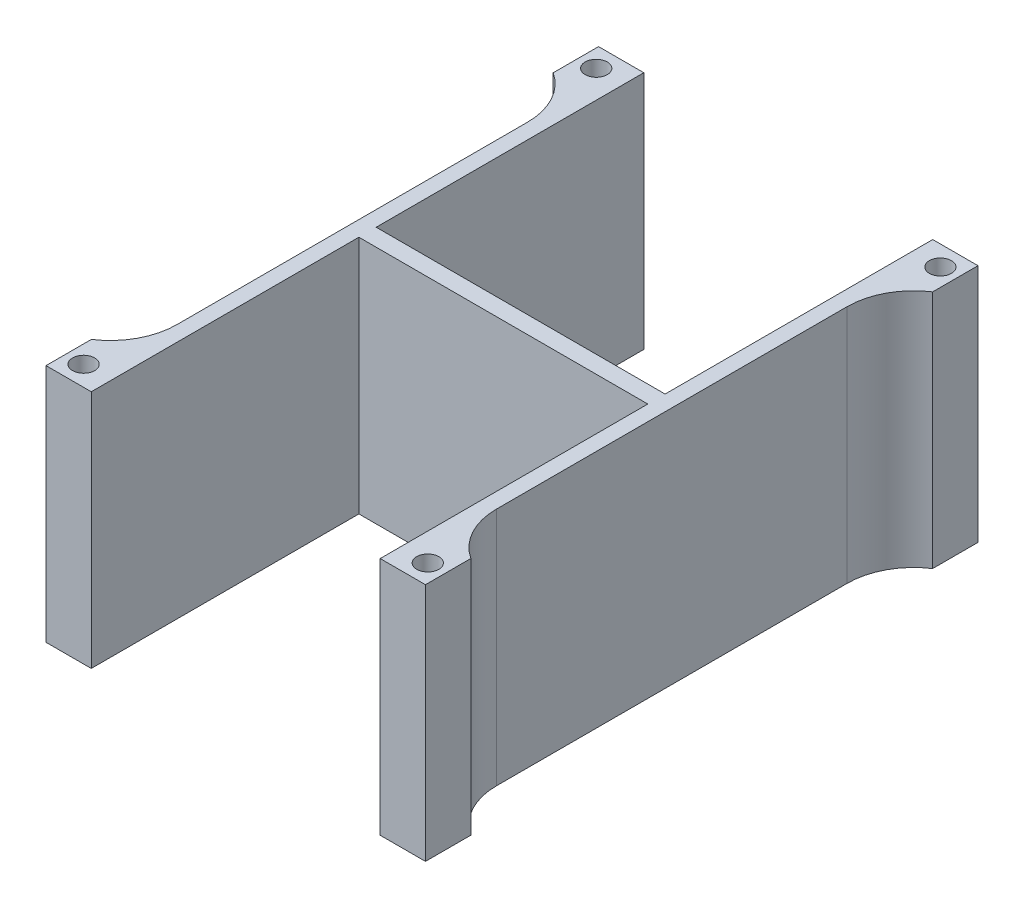
ISO-10303-21;
HEADER;
FILE_DESCRIPTION(('STEP AP214'),'2;1');
FILE_NAME('part.step','',(''),(''),'','','');
FILE_SCHEMA(('AUTOMOTIVE_DESIGN { 1 0 10303 214 1 1 1 1 }'));
ENDSEC;
DATA;
#1=APPLICATION_CONTEXT('core data for automotive mechanical design processes');
#2=APPLICATION_PROTOCOL_DEFINITION('international standard','automotive_design',2000,#1);
#3=PRODUCT_CONTEXT('',#1,'mechanical');
#4=PRODUCT('Part','Part','',(#3));
#5=PRODUCT_RELATED_PRODUCT_CATEGORY('part','',(#4));
#6=PRODUCT_DEFINITION_FORMATION('','',#4);
#7=PRODUCT_DEFINITION_CONTEXT('part definition',#1,'design');
#8=PRODUCT_DEFINITION('design','',#6,#7);
#9=PRODUCT_DEFINITION_SHAPE('','',#8);
#10=(LENGTH_UNIT() NAMED_UNIT(*) SI_UNIT(.MILLI.,.METRE.));
#11=(NAMED_UNIT(*) PLANE_ANGLE_UNIT() SI_UNIT($,.RADIAN.));
#12=(NAMED_UNIT(*) SI_UNIT($,.STERADIAN.) SOLID_ANGLE_UNIT());
#13=UNCERTAINTY_MEASURE_WITH_UNIT(LENGTH_MEASURE(1.E-05),#10,'distance_accuracy_value','');
#14=(GEOMETRIC_REPRESENTATION_CONTEXT(3) GLOBAL_UNCERTAINTY_ASSIGNED_CONTEXT((#13)) GLOBAL_UNIT_ASSIGNED_CONTEXT((#10,
#11,#12)) REPRESENTATION_CONTEXT('',''));
#15=CARTESIAN_POINT('',(0.,0.,0.));
#16=DIRECTION('',(0.,0.,1.));
#17=DIRECTION('',(1.,0.,0.));
#18=AXIS2_PLACEMENT_3D('',#15,#16,#17);
#19=CARTESIAN_POINT('',(-2.49999999999993,43.0000000000001,40.));
#20=DIRECTION('',(1.,0.,0.));
#21=DIRECTION('',(0.,1.,0.));
#22=AXIS2_PLACEMENT_3D('',#19,#20,#21);
#23=PLANE('',#22);
#24=DIRECTION('',(0.,0.,-1.));
#25=VECTOR('',#24,1.);
#26=CARTESIAN_POINT('',(-2.50000000000007,0.,-1.501));
#27=LINE('',#26,#25);
#28=CARTESIAN_POINT('',(-2.50000000000007,0.,24.8348486100883));
#29=VERTEX_POINT('',#28);
#30=CARTESIAN_POINT('',(-2.50000000000007,0.,-27.8348486100883));
#31=VERTEX_POINT('',#30);
#32=EDGE_CURVE('E240',#29,#31,#27,.T.);
#33=ORIENTED_EDGE('',*,*,#32,.F.);
#34=DIRECTION('',(0.,1.,0.));
#35=VECTOR('',#34,1.);
#36=CARTESIAN_POINT('',(-2.49999999999993,43.0000000000001,24.8348486100883));
#37=LINE('',#36,#35);
#38=CARTESIAN_POINT('',(-2.49999999999994,36.0000000000001,24.8348486100883));
#39=VERTEX_POINT('',#38);
#40=EDGE_CURVE('E227',#29,#39,#37,.T.);
#41=ORIENTED_EDGE('',*,*,#40,.T.);
#42=DIRECTION('',(0.,0.,1.));
#43=VECTOR('',#42,1.);
#44=CARTESIAN_POINT('',(-2.49999999999995,36.0000000000001,-43.));
#45=LINE('',#44,#43);
#46=CARTESIAN_POINT('',(-2.49999999999995,36.0000000000001,-27.8348486100883));
#47=VERTEX_POINT('',#46);
#48=EDGE_CURVE('E251',#47,#39,#45,.T.);
#49=ORIENTED_EDGE('',*,*,#48,.F.);
#50=DIRECTION('',(0.,1.,0.));
#51=VECTOR('',#50,1.);
#52=CARTESIAN_POINT('',(-2.49999999999993,43.0000000000001,-27.8348486100883));
#53=LINE('',#52,#51);
#54=EDGE_CURVE('E203',#47,#31,#53,.F.);
#55=ORIENTED_EDGE('',*,*,#54,.T.);
#56=EDGE_LOOP('',(#33,#41,#49,#55));
#57=FACE_BOUND('',#56,.T.);
#58=ADVANCED_FACE('F41',(#57),#23,.F.);
#59=CARTESIAN_POINT('',(45.5000000000001,42.9999999999999,40.));
#60=DIRECTION('',(-1.,0.,0.));
#61=DIRECTION('',(0.,-1.,0.));
#62=AXIS2_PLACEMENT_3D('',#59,#60,#61);
#63=PLANE('',#62);
#64=DIRECTION('',(0.,0.,-1.));
#65=VECTOR('',#64,1.);
#66=CARTESIAN_POINT('',(45.5000000000001,35.9999999999997,-43.));
#67=LINE('',#66,#65);
#68=CARTESIAN_POINT('',(45.5000000000001,35.9999999999997,24.8348486100883));
#69=VERTEX_POINT('',#68);
#70=CARTESIAN_POINT('',(45.5000000000001,35.9999999999997,-27.8348486100883));
#71=VERTEX_POINT('',#70);
#72=EDGE_CURVE('E225',#69,#71,#67,.T.);
#73=ORIENTED_EDGE('',*,*,#72,.F.);
#74=DIRECTION('',(0.,-1.,0.));
#75=VECTOR('',#74,1.);
#76=CARTESIAN_POINT('',(45.5000000000001,42.9999999999999,24.8348486100883));
#77=LINE('',#76,#75);
#78=CARTESIAN_POINT('',(45.5,0.,24.8348486100883));
#79=VERTEX_POINT('',#78);
#80=EDGE_CURVE('E291',#69,#79,#77,.T.);
#81=ORIENTED_EDGE('',*,*,#80,.T.);
#82=DIRECTION('',(0.,0.,1.));
#83=VECTOR('',#82,1.);
#84=CARTESIAN_POINT('',(45.5,0.,-1.501));
#85=LINE('',#84,#83);
#86=CARTESIAN_POINT('',(45.5,0.,-27.8348486100883));
#87=VERTEX_POINT('',#86);
#88=EDGE_CURVE('E246',#87,#79,#85,.T.);
#89=ORIENTED_EDGE('',*,*,#88,.F.);
#90=DIRECTION('',(0.,-1.,0.));
#91=VECTOR('',#90,1.);
#92=CARTESIAN_POINT('',(45.5000000000001,42.9999999999998,-27.8348486100883));
#93=LINE('',#92,#91);
#94=EDGE_CURVE('E289',#87,#71,#93,.F.);
#95=ORIENTED_EDGE('',*,*,#94,.T.);
#96=EDGE_LOOP('',(#73,#81,#89,#95));
#97=FACE_BOUND('',#96,.T.);
#98=ADVANCED_FACE('F407',(#97),#63,.F.);
#99=CARTESIAN_POINT('',(-0.200000000000358,0.,40.));
#100=DIRECTION('',(-1.,0.,0.));
#101=DIRECTION('',(0.,-1.,0.));
#102=AXIS2_PLACEMENT_3D('',#99,#100,#101);
#103=PLANE('',#102);
#104=DIRECTION('',(0.,0.,1.));
#105=VECTOR('',#104,1.);
#106=CARTESIAN_POINT('',(-0.200000000000053,36.0000000000001,0.));
#107=LINE('',#106,#105);
#108=CARTESIAN_POINT('',(-0.200000000000053,35.9999999999999,-0.200000000000008));
#109=VERTEX_POINT('',#108);
#110=CARTESIAN_POINT('',(-0.200000000000058,36.0000000000001,40.));
#111=VERTEX_POINT('',#110);
#112=EDGE_CURVE('E279',#109,#111,#107,.T.);
#113=ORIENTED_EDGE('',*,*,#112,.T.);
#114=DIRECTION('',(0.,1.,0.));
#115=VECTOR('',#114,1.);
#116=CARTESIAN_POINT('',(-0.200000000000358,0.,40.));
#117=LINE('',#116,#115);
#118=CARTESIAN_POINT('',(-0.200000000000358,0.,40.));
#119=VERTEX_POINT('',#118);
#120=EDGE_CURVE('E348',#119,#111,#117,.T.);
#121=ORIENTED_EDGE('',*,*,#120,.F.);
#122=DIRECTION('',(0.,0.,1.));
#123=VECTOR('',#122,1.);
#124=CARTESIAN_POINT('',(-0.200000000000358,0.,40.));
#125=LINE('',#124,#123);
#126=CARTESIAN_POINT('',(-0.200000000000353,0.,-0.200000000000008));
#127=VERTEX_POINT('',#126);
#128=EDGE_CURVE('E371',#127,#119,#125,.T.);
#129=ORIENTED_EDGE('',*,*,#128,.F.);
#130=DIRECTION('',(0.,1.,0.));
#131=VECTOR('',#130,1.);
#132=CARTESIAN_POINT('',(-0.200000000000353,0.,-0.200000000000008));
#133=LINE('',#132,#131);
#134=EDGE_CURVE('E375',#127,#109,#133,.T.);
#135=ORIENTED_EDGE('',*,*,#134,.T.);
#136=EDGE_LOOP('',(#113,#121,#129,#135));
#137=FACE_BOUND('',#136,.T.);
#138=ADVANCED_FACE('F413',(#137),#103,.F.);
#139=CARTESIAN_POINT('',(43.1999999999996,-3.81639164714898E-13,-0.200000000000008));
#140=DIRECTION('',(1.,0.,0.));
#141=DIRECTION('',(0.,1.,0.));
#142=AXIS2_PLACEMENT_3D('',#139,#140,#141);
#143=PLANE('',#142);
#144=DIRECTION('',(0.,1.,0.));
#145=VECTOR('',#144,1.);
#146=CARTESIAN_POINT('',(43.1999999999996,-3.81639164714898E-13,40.));
#147=LINE('',#146,#145);
#148=CARTESIAN_POINT('',(43.1999999999996,-3.81639164714898E-13,40.));
#149=VERTEX_POINT('',#148);
#150=CARTESIAN_POINT('',(43.1999999999999,35.9999999999997,40.));
#151=VERTEX_POINT('',#150);
#152=EDGE_CURVE('E368',#149,#151,#147,.T.);
#153=ORIENTED_EDGE('',*,*,#152,.T.);
#154=DIRECTION('',(0.,0.,-1.));
#155=VECTOR('',#154,1.);
#156=CARTESIAN_POINT('',(43.1999999999999,35.9999999999997,0.));
#157=LINE('',#156,#155);
#158=CARTESIAN_POINT('',(43.1999999999999,35.9999999999997,-0.200000000000008));
#159=VERTEX_POINT('',#158);
#160=EDGE_CURVE('E275',#151,#159,#157,.T.);
#161=ORIENTED_EDGE('',*,*,#160,.T.);
#162=DIRECTION('',(0.,1.,0.));
#163=VECTOR('',#162,1.);
#164=CARTESIAN_POINT('',(43.1999999999996,-3.81639164714898E-13,-0.200000000000008));
#165=LINE('',#164,#163);
#166=CARTESIAN_POINT('',(43.1999999999996,-3.81639164714898E-13,-0.200000000000008));
#167=VERTEX_POINT('',#166);
#168=EDGE_CURVE('E372',#167,#159,#165,.T.);
#169=ORIENTED_EDGE('',*,*,#168,.F.);
#170=DIRECTION('',(0.,0.,-1.));
#171=VECTOR('',#170,1.);
#172=CARTESIAN_POINT('',(43.1999999999996,-3.81639164714898E-13,-0.200000000000008));
#173=LINE('',#172,#171);
#174=EDGE_CURVE('E262',#149,#167,#173,.T.);
#175=ORIENTED_EDGE('',*,*,#174,.F.);
#176=EDGE_LOOP('',(#153,#161,#169,#175));
#177=FACE_BOUND('',#176,.T.);
#178=ADVANCED_FACE('F388',(#177),#143,.F.);
#179=CARTESIAN_POINT('',(43.1999999999996,-3.81639164714898E-13,-2.79999999999999));
#180=DIRECTION('',(1.,0.,0.));
#181=DIRECTION('',(0.,1.,0.));
#182=AXIS2_PLACEMENT_3D('',#179,#180,#181);
#183=PLANE('',#182);
#184=DIRECTION('',(0.,0.,-1.));
#185=VECTOR('',#184,1.);
#186=CARTESIAN_POINT('',(43.1999999999999,35.9999999999997,0.));
#187=LINE('',#186,#185);
#188=CARTESIAN_POINT('',(43.1999999999999,35.9999999999999,-2.79999999999999));
#189=VERTEX_POINT('',#188);
#190=CARTESIAN_POINT('',(43.1999999999999,35.9999999999997,-43.));
#191=VERTEX_POINT('',#190);
#192=EDGE_CURVE('E286',#189,#191,#187,.T.);
#193=ORIENTED_EDGE('',*,*,#192,.T.);
#194=DIRECTION('',(0.,1.,0.));
#195=VECTOR('',#194,1.);
#196=CARTESIAN_POINT('',(43.1999999999996,-3.81639164714898E-13,-43.));
#197=LINE('',#196,#195);
#198=CARTESIAN_POINT('',(43.1999999999996,-3.81639164714898E-13,-43.));
#199=VERTEX_POINT('',#198);
#200=EDGE_CURVE('E253',#199,#191,#197,.T.);
#201=ORIENTED_EDGE('',*,*,#200,.F.);
#202=DIRECTION('',(0.,0.,-1.));
#203=VECTOR('',#202,1.);
#204=CARTESIAN_POINT('',(43.1999999999996,-3.81639164714898E-13,-2.79999999999999));
#205=LINE('',#204,#203);
#206=CARTESIAN_POINT('',(43.1999999999996,-3.81639164714898E-13,-2.79999999999999));
#207=VERTEX_POINT('',#206);
#208=EDGE_CURVE('E357',#207,#199,#205,.T.);
#209=ORIENTED_EDGE('',*,*,#208,.F.);
#210=DIRECTION('',(0.,1.,0.));
#211=VECTOR('',#210,1.);
#212=CARTESIAN_POINT('',(43.1999999999996,-3.81639164714898E-13,-2.79999999999999));
#213=LINE('',#212,#211);
#214=EDGE_CURVE('E259',#207,#189,#213,.T.);
#215=ORIENTED_EDGE('',*,*,#214,.T.);
#216=EDGE_LOOP('',(#193,#201,#209,#215));
#217=FACE_BOUND('',#216,.T.);
#218=ADVANCED_FACE('F441',(#217),#183,.F.);
#219=CARTESIAN_POINT('',(-0.200000000000358,0.,-43.));
#220=DIRECTION('',(-1.,0.,0.));
#221=DIRECTION('',(0.,-1.,0.));
#222=AXIS2_PLACEMENT_3D('',#219,#220,#221);
#223=PLANE('',#222);
#224=DIRECTION('',(0.,1.,0.));
#225=VECTOR('',#224,1.);
#226=CARTESIAN_POINT('',(-0.200000000000358,0.,-43.));
#227=LINE('',#226,#225);
#228=CARTESIAN_POINT('',(-0.200000000000358,0.,-43.));
#229=VERTEX_POINT('',#228);
#230=CARTESIAN_POINT('',(-0.200000000000058,36.0000000000001,-43.));
#231=VERTEX_POINT('',#230);
#232=EDGE_CURVE('E359',#229,#231,#227,.T.);
#233=ORIENTED_EDGE('',*,*,#232,.T.);
#234=DIRECTION('',(0.,0.,1.));
#235=VECTOR('',#234,1.);
#236=CARTESIAN_POINT('',(-0.200000000000053,36.0000000000001,0.));
#237=LINE('',#236,#235);
#238=CARTESIAN_POINT('',(-0.200000000000053,36.0000000000001,-2.79999999999999));
#239=VERTEX_POINT('',#238);
#240=EDGE_CURVE('E282',#231,#239,#237,.T.);
#241=ORIENTED_EDGE('',*,*,#240,.T.);
#242=DIRECTION('',(0.,1.,0.));
#243=VECTOR('',#242,1.);
#244=CARTESIAN_POINT('',(-0.200000000000353,0.,-2.79999999999999));
#245=LINE('',#244,#243);
#246=CARTESIAN_POINT('',(-0.200000000000353,0.,-2.79999999999999));
#247=VERTEX_POINT('',#246);
#248=EDGE_CURVE('E363',#247,#239,#245,.T.);
#249=ORIENTED_EDGE('',*,*,#248,.F.);
#250=DIRECTION('',(0.,0.,1.));
#251=VECTOR('',#250,1.);
#252=CARTESIAN_POINT('',(-0.200000000000358,0.,-43.));
#253=LINE('',#252,#251);
#254=EDGE_CURVE('E351',#229,#247,#253,.T.);
#255=ORIENTED_EDGE('',*,*,#254,.F.);
#256=EDGE_LOOP('',(#233,#241,#249,#255));
#257=FACE_BOUND('',#256,.T.);
#258=ADVANCED_FACE('F402',(#257),#223,.F.);
#259=CARTESIAN_POINT('',(0.,0.,40.));
#260=DIRECTION('',(0.,0.,-1.));
#261=DIRECTION('',(-1.,0.,0.));
#262=AXIS2_PLACEMENT_3D('',#259,#260,#261);
#263=PLANE('',#262);
#264=DIRECTION('',(1.,0.,0.));
#265=VECTOR('',#264,1.);
#266=CARTESIAN_POINT('',(-2.49999999999995,36.0000000000001,40.));
#267=LINE('',#266,#265);
#268=CARTESIAN_POINT('',(-7.0000000000002,36.0000000000001,40.));
#269=VERTEX_POINT('',#268);
#270=EDGE_CURVE('E256',#269,#111,#267,.T.);
#271=ORIENTED_EDGE('',*,*,#270,.F.);
#272=DIRECTION('',(0.,-1.,0.));
#273=VECTOR('',#272,1.);
#274=CARTESIAN_POINT('',(-7.0000000000005,0.,40.));
#275=LINE('',#274,#273);
#276=CARTESIAN_POINT('',(-7.0000000000005,-3.95516952522712E-13,40.));
#277=VERTEX_POINT('',#276);
#278=EDGE_CURVE('E318',#269,#277,#275,.T.);
#279=ORIENTED_EDGE('',*,*,#278,.T.);
#280=DIRECTION('',(-1.,0.,0.));
#281=VECTOR('',#280,1.);
#282=CARTESIAN_POINT('',(-4.22762533667264,0.,40.));
#283=LINE('',#282,#281);
#284=EDGE_CURVE('E245',#119,#277,#283,.T.);
#285=ORIENTED_EDGE('',*,*,#284,.F.);
#286=ORIENTED_EDGE('',*,*,#120,.T.);
#287=EDGE_LOOP('',(#271,#279,#285,#286));
#288=FACE_BOUND('',#287,.T.);
#289=ADVANCED_FACE('F393',(#288),#263,.F.);
#290=CARTESIAN_POINT('',(49.9999999999998,-8.67361737988404E-13,40.));
#291=VERTEX_POINT('',#290);
#292=EDGE_CURVE('E273',#291,#149,#283,.T.);
#293=ORIENTED_EDGE('',*,*,#292,.F.);
#294=DIRECTION('',(0.,1.,0.));
#295=VECTOR('',#294,1.);
#296=CARTESIAN_POINT('',(49.9999999999998,-4.16333634234394E-13,40.));
#297=LINE('',#296,#295);
#298=CARTESIAN_POINT('',(50.0000000000001,35.9999999999997,40.));
#299=VERTEX_POINT('',#298);
#300=EDGE_CURVE('E324',#291,#299,#297,.T.);
#301=ORIENTED_EDGE('',*,*,#300,.T.);
#302=EDGE_CURVE('E252',#151,#299,#267,.T.);
#303=ORIENTED_EDGE('',*,*,#302,.F.);
#304=ORIENTED_EDGE('',*,*,#152,.F.);
#305=EDGE_LOOP('',(#293,#301,#303,#304));
#306=FACE_BOUND('',#305,.T.);
#307=ADVANCED_FACE('F390',(#306),#263,.F.);
#308=CARTESIAN_POINT('',(0.,0.,-43.));
#309=DIRECTION('',(0.,0.,1.));
#310=DIRECTION('',(-1.,0.,0.));
#311=AXIS2_PLACEMENT_3D('',#308,#309,#310);
#312=PLANE('',#311);
#313=DIRECTION('',(-1.,0.,0.));
#314=VECTOR('',#313,1.);
#315=CARTESIAN_POINT('',(-2.49999999999995,36.0000000000001,-43.));
#316=LINE('',#315,#314);
#317=CARTESIAN_POINT('',(50.0000000000001,35.9999999999997,-43.));
#318=VERTEX_POINT('',#317);
#319=EDGE_CURVE('E266',#318,#191,#316,.T.);
#320=ORIENTED_EDGE('',*,*,#319,.F.);
#321=DIRECTION('',(0.,-1.,0.));
#322=VECTOR('',#321,1.);
#323=CARTESIAN_POINT('',(49.9999999999998,-4.16333634234394E-13,-43.));
#324=LINE('',#323,#322);
#325=CARTESIAN_POINT('',(49.9999999999998,-8.67361737988404E-13,-43.));
#326=VERTEX_POINT('',#325);
#327=EDGE_CURVE('E321',#318,#326,#324,.T.);
#328=ORIENTED_EDGE('',*,*,#327,.T.);
#329=DIRECTION('',(-1.,0.,0.));
#330=VECTOR('',#329,1.);
#331=CARTESIAN_POINT('',(-4.22762533667264,0.,-43.));
#332=LINE('',#331,#330);
#333=EDGE_CURVE('E269',#326,#199,#332,.T.);
#334=ORIENTED_EDGE('',*,*,#333,.T.);
#335=ORIENTED_EDGE('',*,*,#200,.T.);
#336=EDGE_LOOP('',(#320,#328,#334,#335));
#337=FACE_BOUND('',#336,.T.);
#338=ADVANCED_FACE('F392',(#337),#312,.F.);
#339=CARTESIAN_POINT('',(-7.00000000000051,-3.95516952522712E-13,-43.));
#340=VERTEX_POINT('',#339);
#341=EDGE_CURVE('E268',#229,#340,#332,.T.);
#342=ORIENTED_EDGE('',*,*,#341,.T.);
#343=DIRECTION('',(0.,1.,0.));
#344=VECTOR('',#343,1.);
#345=CARTESIAN_POINT('',(-7.00000000000051,0.,-43.));
#346=LINE('',#345,#344);
#347=CARTESIAN_POINT('',(-7.00000000000021,36.0000000000001,-43.));
#348=VERTEX_POINT('',#347);
#349=EDGE_CURVE('E315',#340,#348,#346,.T.);
#350=ORIENTED_EDGE('',*,*,#349,.T.);
#351=EDGE_CURVE('E199',#231,#348,#316,.T.);
#352=ORIENTED_EDGE('',*,*,#351,.F.);
#353=ORIENTED_EDGE('',*,*,#232,.F.);
#354=EDGE_LOOP('',(#342,#350,#352,#353));
#355=FACE_BOUND('',#354,.T.);
#356=ADVANCED_FACE('F399',(#355),#312,.F.);
#357=CARTESIAN_POINT('',(-4.22762533667264,0.,-1.501));
#358=DIRECTION('',(0.,1.,0.));
#359=DIRECTION('',(0.,0.,1.));
#360=AXIS2_PLACEMENT_3D('',#357,#358,#359);
#361=PLANE('',#360);
#362=ORIENTED_EDGE('',*,*,#284,.T.);
#363=DIRECTION('',(0.,0.,-1.));
#364=VECTOR('',#363,1.);
#365=CARTESIAN_POINT('',(-7.00000000000051,-3.95516952522712E-13,42.9367666246883));
#366=LINE('',#365,#364);
#367=CARTESIAN_POINT('',(-7.0000000000005,-4.01100320108022E-13,33.1864951543336));
#368=VERTEX_POINT('',#367);
#369=EDGE_CURVE('E241',#277,#368,#366,.T.);
#370=ORIENTED_EDGE('',*,*,#369,.T.);
#371=CARTESIAN_POINT('',(-12.5000000000001,0.,24.8348486100883));
#372=DIRECTION('',(0.,1.,0.));
#373=DIRECTION('',(0.,0.,1.));
#374=AXIS2_PLACEMENT_3D('',#371,#372,#373);
#375=CIRCLE('',#374,10.);
#376=EDGE_CURVE('E208',#368,#29,#375,.T.);
#377=ORIENTED_EDGE('',*,*,#376,.T.);
#378=ORIENTED_EDGE('',*,*,#32,.T.);
#379=CARTESIAN_POINT('',(-12.5000000000001,0.,-27.8348486100883));
#380=DIRECTION('',(0.,1.,0.));
#381=DIRECTION('',(0.,0.,1.));
#382=AXIS2_PLACEMENT_3D('',#379,#380,#381);
#383=CIRCLE('',#382,10.);
#384=CARTESIAN_POINT('',(-7.00000000000051,0.,-36.1864951543336));
#385=VERTEX_POINT('',#384);
#386=EDGE_CURVE('E188',#31,#385,#383,.T.);
#387=ORIENTED_EDGE('',*,*,#386,.T.);
#388=DIRECTION('',(0.,0.,-1.));
#389=VECTOR('',#388,1.);
#390=CARTESIAN_POINT('',(-7.00000000000051,-3.95516952522712E-13,-45.9367666246883));
#391=LINE('',#390,#389);
#392=EDGE_CURVE('E182',#385,#340,#391,.T.);
#393=ORIENTED_EDGE('',*,*,#392,.T.);
#394=ORIENTED_EDGE('',*,*,#341,.F.);
#395=ORIENTED_EDGE('',*,*,#254,.T.);
#396=DIRECTION('',(1.,0.,0.));
#397=VECTOR('',#396,1.);
#398=CARTESIAN_POINT('',(-0.200000000000353,0.,-2.79999999999999));
#399=LINE('',#398,#397);
#400=EDGE_CURVE('E354',#247,#207,#399,.T.);
#401=ORIENTED_EDGE('',*,*,#400,.T.);
#402=ORIENTED_EDGE('',*,*,#208,.T.);
#403=ORIENTED_EDGE('',*,*,#333,.F.);
#404=DIRECTION('',(0.,0.,1.));
#405=VECTOR('',#404,1.);
#406=CARTESIAN_POINT('',(49.9999999999998,-8.67361737988404E-13,-45.9367666246883));
#407=LINE('',#406,#405);
#408=CARTESIAN_POINT('',(49.9999999999998,-8.68717264306995E-13,-36.1864951543332));
#409=VERTEX_POINT('',#408);
#410=EDGE_CURVE('E307',#326,#409,#407,.T.);
#411=ORIENTED_EDGE('',*,*,#410,.T.);
#412=CARTESIAN_POINT('',(55.5,0.,-27.8348486100883));
#413=DIRECTION('',(0.,1.,0.));
#414=DIRECTION('',(0.,0.,1.));
#415=AXIS2_PLACEMENT_3D('',#412,#413,#414);
#416=CIRCLE('',#415,10.);
#417=EDGE_CURVE('E220',#409,#87,#416,.T.);
#418=ORIENTED_EDGE('',*,*,#417,.T.);
#419=ORIENTED_EDGE('',*,*,#88,.T.);
#420=CARTESIAN_POINT('',(55.5,0.,24.8348486100883));
#421=DIRECTION('',(0.,1.,0.));
#422=DIRECTION('',(0.,0.,1.));
#423=AXIS2_PLACEMENT_3D('',#420,#421,#422);
#424=CIRCLE('',#423,10.);
#425=CARTESIAN_POINT('',(49.9999999999998,0.,33.1864951543332));
#426=VERTEX_POINT('',#425);
#427=EDGE_CURVE('E229',#79,#426,#424,.T.);
#428=ORIENTED_EDGE('',*,*,#427,.T.);
#429=DIRECTION('',(0.,0.,1.));
#430=VECTOR('',#429,1.);
#431=CARTESIAN_POINT('',(49.9999999999998,-8.67361737988404E-13,42.9367666246883));
#432=LINE('',#431,#430);
#433=EDGE_CURVE('E56',#426,#291,#432,.T.);
#434=ORIENTED_EDGE('',*,*,#433,.T.);
#435=ORIENTED_EDGE('',*,*,#292,.T.);
#436=ORIENTED_EDGE('',*,*,#174,.T.);
#437=DIRECTION('',(-1.,0.,0.));
#438=VECTOR('',#437,1.);
#439=CARTESIAN_POINT('',(-0.200000000000353,0.,-0.200000000000008));
#440=LINE('',#439,#438);
#441=EDGE_CURVE('E381',#167,#127,#440,.T.);
#442=ORIENTED_EDGE('',*,*,#441,.T.);
#443=ORIENTED_EDGE('',*,*,#128,.T.);
#444=EDGE_LOOP('',(#362,#370,#377,#378,#387,#393,#394,#395,#401,#402,#403,#411,#418,#419,#428,
#434,#435,#436,#442,#443));
#445=FACE_BOUND('',#444,.T.);
#446=ADVANCED_FACE('F239',(#445),#361,.F.);
#447=CARTESIAN_POINT('',(3.04704178555292E-13,36.0000000000001,0.));
#448=DIRECTION('',(0.,1.,0.));
#449=DIRECTION('',(-1.,0.,0.));
#450=AXIS2_PLACEMENT_3D('',#447,#448,#449);
#451=PLANE('',#450);
#452=DIRECTION('',(0.,0.,-1.));
#453=VECTOR('',#452,1.);
#454=CARTESIAN_POINT('',(-7.00000000000021,36.0000000000001,42.9367666246883));
#455=LINE('',#454,#453);
#456=CARTESIAN_POINT('',(-7.0000000000002,36.0000000000001,33.1864951543335));
#457=VERTEX_POINT('',#456);
#458=EDGE_CURVE('E200',#269,#457,#455,.T.);
#459=ORIENTED_EDGE('',*,*,#458,.F.);
#460=ORIENTED_EDGE('',*,*,#270,.T.);
#461=ORIENTED_EDGE('',*,*,#112,.F.);
#462=DIRECTION('',(-1.,0.,0.));
#463=VECTOR('',#462,1.);
#464=CARTESIAN_POINT('',(3.04704178555292E-13,36.0000000000001,-0.200000000000008));
#465=LINE('',#464,#463);
#466=EDGE_CURVE('E277',#159,#109,#465,.T.);
#467=ORIENTED_EDGE('',*,*,#466,.F.);
#468=ORIENTED_EDGE('',*,*,#160,.F.);
#469=ORIENTED_EDGE('',*,*,#302,.T.);
#470=DIRECTION('',(0.,0.,1.));
#471=VECTOR('',#470,1.);
#472=CARTESIAN_POINT('',(50.0000000000001,35.9999999999997,42.9367666246883));
#473=LINE('',#472,#471);
#474=CARTESIAN_POINT('',(50.0000000000001,35.9999999999997,33.1864951543334));
#475=VERTEX_POINT('',#474);
#476=EDGE_CURVE('E304',#475,#299,#473,.T.);
#477=ORIENTED_EDGE('',*,*,#476,.F.);
#478=CARTESIAN_POINT('',(55.5000000000001,35.9999999999996,24.8348486100883));
#479=DIRECTION('',(0.,1.,0.));
#480=DIRECTION('',(-1.,0.,0.));
#481=AXIS2_PLACEMENT_3D('',#478,#479,#480);
#482=CIRCLE('',#481,10.);
#483=EDGE_CURVE('E293',#475,#69,#482,.F.);
#484=ORIENTED_EDGE('',*,*,#483,.T.);
#485=ORIENTED_EDGE('',*,*,#72,.T.);
#486=CARTESIAN_POINT('',(55.5000000000001,35.9999999999996,-27.8348486100883));
#487=DIRECTION('',(0.,1.,0.));
#488=DIRECTION('',(-1.,0.,0.));
#489=AXIS2_PLACEMENT_3D('',#486,#487,#488);
#490=CIRCLE('',#489,10.);
#491=CARTESIAN_POINT('',(50.0000000000001,35.9999999999997,-36.1864951543334));
#492=VERTEX_POINT('',#491);
#493=EDGE_CURVE('E219',#71,#492,#490,.F.);
#494=ORIENTED_EDGE('',*,*,#493,.T.);
#495=DIRECTION('',(0.,0.,1.));
#496=VECTOR('',#495,1.);
#497=CARTESIAN_POINT('',(50.0000000000001,35.9999999999997,-45.9367666246883));
#498=LINE('',#497,#496);
#499=EDGE_CURVE('E63',#318,#492,#498,.T.);
#500=ORIENTED_EDGE('',*,*,#499,.F.);
#501=ORIENTED_EDGE('',*,*,#319,.T.);
#502=ORIENTED_EDGE('',*,*,#192,.F.);
#503=DIRECTION('',(1.,0.,0.));
#504=VECTOR('',#503,1.);
#505=CARTESIAN_POINT('',(3.04704178555292E-13,36.0000000000001,-2.79999999999999));
#506=LINE('',#505,#504);
#507=EDGE_CURVE('E284',#239,#189,#506,.T.);
#508=ORIENTED_EDGE('',*,*,#507,.F.);
#509=ORIENTED_EDGE('',*,*,#240,.F.);
#510=ORIENTED_EDGE('',*,*,#351,.T.);
#511=DIRECTION('',(0.,0.,-1.));
#512=VECTOR('',#511,1.);
#513=CARTESIAN_POINT('',(-7.00000000000021,36.0000000000001,-45.9367666246883));
#514=LINE('',#513,#512);
#515=CARTESIAN_POINT('',(-7.00000000000021,36.0000000000001,-36.1864951543335));
#516=VERTEX_POINT('',#515);
#517=EDGE_CURVE('E179',#516,#348,#514,.T.);
#518=ORIENTED_EDGE('',*,*,#517,.F.);
#519=CARTESIAN_POINT('',(-12.5,36.0000000000002,-27.8348486100883));
#520=DIRECTION('',(0.,1.,0.));
#521=DIRECTION('',(-1.,0.,0.));
#522=AXIS2_PLACEMENT_3D('',#519,#520,#521);
#523=CIRCLE('',#522,10.);
#524=EDGE_CURVE('E196',#516,#47,#523,.F.);
#525=ORIENTED_EDGE('',*,*,#524,.T.);
#526=ORIENTED_EDGE('',*,*,#48,.T.);
#527=CARTESIAN_POINT('',(-12.5,36.0000000000002,24.8348486100883));
#528=DIRECTION('',(0.,1.,0.));
#529=DIRECTION('',(-1.,0.,0.));
#530=AXIS2_PLACEMENT_3D('',#527,#528,#529);
#531=CIRCLE('',#530,10.);
#532=EDGE_CURVE('E204',#39,#457,#531,.F.);
#533=ORIENTED_EDGE('',*,*,#532,.T.);
#534=EDGE_LOOP('',(#459,#460,#461,#467,#468,#469,#477,#484,#485,#494,#500,#501,#502,#508,#509,
#510,#518,#525,#526,#533));
#535=FACE_BOUND('',#534,.T.);
#536=CARTESIAN_POINT('',(-4.35,36.0000000000001,37.));
#537=DIRECTION('',(0.,1.,0.));
#538=DIRECTION('',(1.,0.,0.));
#539=AXIS2_PLACEMENT_3D('',#536,#537,#538);
#540=CIRCLE('',#539,1.66);
#541=CARTESIAN_POINT('',(-2.69000000000001,36.0000000000001,37.));
#542=VERTEX_POINT('',#541);
#543=EDGE_CURVE('E340',#542,#542,#540,.T.);
#544=ORIENTED_EDGE('',*,*,#543,.F.);
#545=EDGE_LOOP('',(#544));
#546=FACE_BOUND('',#545,.T.);
#547=CARTESIAN_POINT('',(47.3499999999999,35.9999999999997,37.));
#548=DIRECTION('',(0.,1.,0.));
#549=DIRECTION('',(-1.,0.,0.));
#550=AXIS2_PLACEMENT_3D('',#547,#548,#549);
#551=CIRCLE('',#550,1.66);
#552=CARTESIAN_POINT('',(45.6899999999999,35.9999999999997,37.));
#553=VERTEX_POINT('',#552);
#554=EDGE_CURVE('E334',#553,#553,#551,.T.);
#555=ORIENTED_EDGE('',*,*,#554,.F.);
#556=EDGE_LOOP('',(#555));
#557=FACE_BOUND('',#556,.T.);
#558=CARTESIAN_POINT('',(47.3499999999999,35.9999999999997,-40.));
#559=DIRECTION('',(0.,1.,0.));
#560=DIRECTION('',(1.,0.,0.));
#561=AXIS2_PLACEMENT_3D('',#558,#559,#560);
#562=CIRCLE('',#561,1.66);
#563=CARTESIAN_POINT('',(49.0099999999999,35.9999999999997,-40.));
#564=VERTEX_POINT('',#563);
#565=EDGE_CURVE('E327',#564,#564,#562,.T.);
#566=ORIENTED_EDGE('',*,*,#565,.F.);
#567=EDGE_LOOP('',(#566));
#568=FACE_BOUND('',#567,.T.);
#569=CARTESIAN_POINT('',(-4.35,36.0000000000001,-40.));
#570=DIRECTION('',(0.,1.,0.));
#571=DIRECTION('',(-1.,0.,0.));
#572=AXIS2_PLACEMENT_3D('',#569,#570,#571);
#573=CIRCLE('',#572,1.66);
#574=CARTESIAN_POINT('',(-6.01,36.0000000000001,-40.));
#575=VERTEX_POINT('',#574);
#576=EDGE_CURVE('E330',#575,#575,#573,.T.);
#577=ORIENTED_EDGE('',*,*,#576,.F.);
#578=EDGE_LOOP('',(#577));
#579=FACE_BOUND('',#578,.T.);
#580=ADVANCED_FACE('F193',(#535,#546,#557,#568,#579),#451,.T.);
#581=CARTESIAN_POINT('',(-0.200000000000353,0.,-0.200000000000008));
#582=DIRECTION('',(0.,0.,-1.));
#583=DIRECTION('',(0.,1.,0.));
#584=AXIS2_PLACEMENT_3D('',#581,#582,#583);
#585=PLANE('',#584);
#586=ORIENTED_EDGE('',*,*,#466,.T.);
#587=ORIENTED_EDGE('',*,*,#134,.F.);
#588=ORIENTED_EDGE('',*,*,#441,.F.);
#589=ORIENTED_EDGE('',*,*,#168,.T.);
#590=EDGE_LOOP('',(#586,#587,#588,#589));
#591=FACE_BOUND('',#590,.T.);
#592=ADVANCED_FACE('F447',(#591),#585,.F.);
#593=CARTESIAN_POINT('',(-0.200000000000353,0.,-2.79999999999999));
#594=DIRECTION('',(0.,0.,1.));
#595=DIRECTION('',(0.,-1.,0.));
#596=AXIS2_PLACEMENT_3D('',#593,#594,#595);
#597=PLANE('',#596);
#598=ORIENTED_EDGE('',*,*,#507,.T.);
#599=ORIENTED_EDGE('',*,*,#214,.F.);
#600=ORIENTED_EDGE('',*,*,#400,.F.);
#601=ORIENTED_EDGE('',*,*,#248,.T.);
#602=EDGE_LOOP('',(#598,#599,#600,#601));
#603=FACE_BOUND('',#602,.T.);
#604=ADVANCED_FACE('F418',(#603),#597,.F.);
#605=CARTESIAN_POINT('',(55.5000000000001,35.9999999999997,24.8348486100883));
#606=DIRECTION('',(0.,-1.,0.));
#607=DIRECTION('',(1.,0.,0.));
#608=AXIS2_PLACEMENT_3D('',#605,#606,#607);
#609=CYLINDRICAL_SURFACE('',#608,10.);
#610=ORIENTED_EDGE('',*,*,#483,.F.);
#611=DIRECTION('',(0.,-1.,0.));
#612=VECTOR('',#611,1.);
#613=CARTESIAN_POINT('',(50.0000000000001,35.9999999999998,33.1864951543334));
#614=LINE('',#613,#612);
#615=EDGE_CURVE('E11',#475,#426,#614,.T.);
#616=ORIENTED_EDGE('',*,*,#615,.T.);
#617=ORIENTED_EDGE('',*,*,#427,.F.);
#618=ORIENTED_EDGE('',*,*,#80,.F.);
#619=EDGE_LOOP('',(#610,#616,#617,#618));
#620=FACE_BOUND('',#619,.T.);
#621=ADVANCED_FACE('F301',(#620),#609,.F.);
#622=CARTESIAN_POINT('',(55.5000000000001,35.9999999999997,-27.8348486100883));
#623=DIRECTION('',(0.,-1.,0.));
#624=DIRECTION('',(1.,0.,0.));
#625=AXIS2_PLACEMENT_3D('',#622,#623,#624);
#626=CYLINDRICAL_SURFACE('',#625,10.);
#627=ORIENTED_EDGE('',*,*,#417,.F.);
#628=DIRECTION('',(0.,-1.,0.));
#629=VECTOR('',#628,1.);
#630=CARTESIAN_POINT('',(50.0000000000001,35.9999999999998,-36.1864951543334));
#631=LINE('',#630,#629);
#632=EDGE_CURVE('E49',#409,#492,#631,.F.);
#633=ORIENTED_EDGE('',*,*,#632,.T.);
#634=ORIENTED_EDGE('',*,*,#493,.F.);
#635=ORIENTED_EDGE('',*,*,#94,.F.);
#636=EDGE_LOOP('',(#627,#633,#634,#635));
#637=FACE_BOUND('',#636,.T.);
#638=ADVANCED_FACE('F217',(#637),#626,.F.);
#639=CARTESIAN_POINT('',(-12.5,36.0000000000001,24.8348486100883));
#640=DIRECTION('',(0.,1.,0.));
#641=DIRECTION('',(-1.,0.,0.));
#642=AXIS2_PLACEMENT_3D('',#639,#640,#641);
#643=CYLINDRICAL_SURFACE('',#642,10.);
#644=ORIENTED_EDGE('',*,*,#376,.F.);
#645=DIRECTION('',(0.,1.,0.));
#646=VECTOR('',#645,1.);
#647=CARTESIAN_POINT('',(-7.0000000000002,36.0000000000001,33.1864951543335));
#648=LINE('',#647,#646);
#649=EDGE_CURVE('E187',#368,#457,#648,.T.);
#650=ORIENTED_EDGE('',*,*,#649,.T.);
#651=ORIENTED_EDGE('',*,*,#532,.F.);
#652=ORIENTED_EDGE('',*,*,#40,.F.);
#653=EDGE_LOOP('',(#644,#650,#651,#652));
#654=FACE_BOUND('',#653,.T.);
#655=ADVANCED_FACE('F249',(#654),#643,.F.);
#656=CARTESIAN_POINT('',(-12.5,36.0000000000001,-27.8348486100883));
#657=DIRECTION('',(0.,1.,0.));
#658=DIRECTION('',(-1.,0.,0.));
#659=AXIS2_PLACEMENT_3D('',#656,#657,#658);
#660=CYLINDRICAL_SURFACE('',#659,10.);
#661=ORIENTED_EDGE('',*,*,#524,.F.);
#662=DIRECTION('',(0.,1.,0.));
#663=VECTOR('',#662,1.);
#664=CARTESIAN_POINT('',(-7.00000000000021,36.0000000000001,-36.1864951543335));
#665=LINE('',#664,#663);
#666=EDGE_CURVE('E176',#516,#385,#665,.F.);
#667=ORIENTED_EDGE('',*,*,#666,.T.);
#668=ORIENTED_EDGE('',*,*,#386,.F.);
#669=ORIENTED_EDGE('',*,*,#54,.F.);
#670=EDGE_LOOP('',(#661,#667,#668,#669));
#671=FACE_BOUND('',#670,.T.);
#672=ADVANCED_FACE('F43',(#671),#660,.F.);
#673=CARTESIAN_POINT('',(-4.35000000000009,26.0000000000001,-40.));
#674=DIRECTION('',(0.,1.,0.));
#675=DIRECTION('',(-1.,0.,0.));
#676=AXIS2_PLACEMENT_3D('',#673,#674,#675);
#677=CYLINDRICAL_SURFACE('',#676,1.66);
#678=CARTESIAN_POINT('',(-4.35000000000009,26.0000000000001,-40.));
#679=DIRECTION('',(0.,1.,0.));
#680=DIRECTION('',(-1.,0.,0.));
#681=AXIS2_PLACEMENT_3D('',#678,#679,#680);
#682=CIRCLE('',#681,1.66);
#683=CARTESIAN_POINT('',(-6.01000000000009,26.0000000000001,-40.));
#684=VERTEX_POINT('',#683);
#685=EDGE_CURVE('E345',#684,#684,#682,.T.);
#686=ORIENTED_EDGE('',*,*,#685,.F.);
#687=EDGE_LOOP('',(#686));
#688=FACE_BOUND('',#687,.T.);
#689=ORIENTED_EDGE('',*,*,#576,.T.);
#690=EDGE_LOOP('',(#689));
#691=FACE_BOUND('',#690,.T.);
#692=ADVANCED_FACE('F424',(#688,#691),#677,.F.);
#693=CARTESIAN_POINT('',(-4.35000000000009,26.0000000000001,-40.));
#694=DIRECTION('',(0.,1.,0.));
#695=DIRECTION('',(-1.,0.,0.));
#696=AXIS2_PLACEMENT_3D('',#693,#694,#695);
#697=PLANE('',#696);
#698=ORIENTED_EDGE('',*,*,#685,.T.);
#699=EDGE_LOOP('',(#698));
#700=FACE_BOUND('',#699,.T.);
#701=ADVANCED_FACE('F428',(#700),#697,.T.);
#702=CARTESIAN_POINT('',(47.3499999999998,25.9999999999997,-40.));
#703=DIRECTION('',(0.,1.,0.));
#704=DIRECTION('',(-1.,0.,0.));
#705=AXIS2_PLACEMENT_3D('',#702,#703,#704);
#706=CYLINDRICAL_SURFACE('',#705,1.66);
#707=CARTESIAN_POINT('',(47.3499999999998,25.9999999999997,-40.));
#708=DIRECTION('',(0.,1.,0.));
#709=DIRECTION('',(1.,0.,0.));
#710=AXIS2_PLACEMENT_3D('',#707,#708,#709);
#711=CIRCLE('',#710,1.66);
#712=CARTESIAN_POINT('',(49.0099999999998,25.9999999999997,-40.));
#713=VERTEX_POINT('',#712);
#714=EDGE_CURVE('E331',#713,#713,#711,.T.);
#715=ORIENTED_EDGE('',*,*,#714,.F.);
#716=EDGE_LOOP('',(#715));
#717=FACE_BOUND('',#716,.T.);
#718=ORIENTED_EDGE('',*,*,#565,.T.);
#719=EDGE_LOOP('',(#718));
#720=FACE_BOUND('',#719,.T.);
#721=ADVANCED_FACE('F434',(#717,#720),#706,.F.);
#722=CARTESIAN_POINT('',(47.3499999999998,25.9999999999997,-40.));
#723=DIRECTION('',(0.,-1.,0.));
#724=DIRECTION('',(1.,0.,0.));
#725=AXIS2_PLACEMENT_3D('',#722,#723,#724);
#726=PLANE('',#725);
#727=ORIENTED_EDGE('',*,*,#714,.T.);
#728=EDGE_LOOP('',(#727));
#729=FACE_BOUND('',#728,.T.);
#730=ADVANCED_FACE('F493',(#729),#726,.F.);
#731=CARTESIAN_POINT('',(47.3499999999998,25.9999999999997,37.));
#732=DIRECTION('',(0.,1.,0.));
#733=DIRECTION('',(-1.,0.,0.));
#734=AXIS2_PLACEMENT_3D('',#731,#732,#733);
#735=CYLINDRICAL_SURFACE('',#734,1.66);
#736=CARTESIAN_POINT('',(47.3499999999998,25.9999999999997,37.));
#737=DIRECTION('',(0.,1.,0.));
#738=DIRECTION('',(-1.,0.,0.));
#739=AXIS2_PLACEMENT_3D('',#736,#737,#738);
#740=CIRCLE('',#739,1.66);
#741=CARTESIAN_POINT('',(45.6899999999998,25.9999999999997,37.));
#742=VERTEX_POINT('',#741);
#743=EDGE_CURVE('E337',#742,#742,#740,.T.);
#744=ORIENTED_EDGE('',*,*,#743,.F.);
#745=EDGE_LOOP('',(#744));
#746=FACE_BOUND('',#745,.T.);
#747=ORIENTED_EDGE('',*,*,#554,.T.);
#748=EDGE_LOOP('',(#747));
#749=FACE_BOUND('',#748,.T.);
#750=ADVANCED_FACE('F497',(#746,#749),#735,.F.);
#751=CARTESIAN_POINT('',(47.3499999999998,25.9999999999997,37.));
#752=DIRECTION('',(0.,1.,0.));
#753=DIRECTION('',(-1.,0.,0.));
#754=AXIS2_PLACEMENT_3D('',#751,#752,#753);
#755=PLANE('',#754);
#756=ORIENTED_EDGE('',*,*,#743,.T.);
#757=EDGE_LOOP('',(#756));
#758=FACE_BOUND('',#757,.T.);
#759=ADVANCED_FACE('F501',(#758),#755,.T.);
#760=CARTESIAN_POINT('',(-4.35000000000009,26.0000000000001,37.));
#761=DIRECTION('',(0.,1.,0.));
#762=DIRECTION('',(-1.,0.,0.));
#763=AXIS2_PLACEMENT_3D('',#760,#761,#762);
#764=CYLINDRICAL_SURFACE('',#763,1.66);
#765=CARTESIAN_POINT('',(-4.35000000000009,26.0000000000001,37.));
#766=DIRECTION('',(0.,1.,0.));
#767=DIRECTION('',(1.,0.,0.));
#768=AXIS2_PLACEMENT_3D('',#765,#766,#767);
#769=CIRCLE('',#768,1.66);
#770=CARTESIAN_POINT('',(-2.69000000000009,26.0000000000001,37.));
#771=VERTEX_POINT('',#770);
#772=EDGE_CURVE('E326',#771,#771,#769,.T.);
#773=ORIENTED_EDGE('',*,*,#772,.F.);
#774=EDGE_LOOP('',(#773));
#775=FACE_BOUND('',#774,.T.);
#776=ORIENTED_EDGE('',*,*,#543,.T.);
#777=EDGE_LOOP('',(#776));
#778=FACE_BOUND('',#777,.T.);
#779=ADVANCED_FACE('F505',(#775,#778),#764,.F.);
#780=CARTESIAN_POINT('',(-4.35000000000009,26.0000000000001,37.));
#781=DIRECTION('',(0.,-1.,0.));
#782=DIRECTION('',(1.,0.,0.));
#783=AXIS2_PLACEMENT_3D('',#780,#781,#782);
#784=PLANE('',#783);
#785=ORIENTED_EDGE('',*,*,#772,.T.);
#786=EDGE_LOOP('',(#785));
#787=FACE_BOUND('',#786,.T.);
#788=ADVANCED_FACE('F490',(#787),#784,.F.);
#789=CARTESIAN_POINT('',(-7.00000000000051,-3.95516952522712E-13,-45.9367666246883));
#790=DIRECTION('',(1.,0.,0.));
#791=DIRECTION('',(0.,1.,0.));
#792=AXIS2_PLACEMENT_3D('',#789,#790,#791);
#793=PLANE('',#792);
#794=ORIENTED_EDGE('',*,*,#392,.F.);
#795=ORIENTED_EDGE('',*,*,#666,.F.);
#796=ORIENTED_EDGE('',*,*,#517,.T.);
#797=ORIENTED_EDGE('',*,*,#349,.F.);
#798=EDGE_LOOP('',(#794,#795,#796,#797));
#799=FACE_BOUND('',#798,.T.);
#800=ADVANCED_FACE('F178',(#799),#793,.F.);
#801=CARTESIAN_POINT('',(-7.00000000000051,-3.95516952522712E-13,42.9367666246883));
#802=DIRECTION('',(1.,0.,0.));
#803=DIRECTION('',(0.,1.,0.));
#804=AXIS2_PLACEMENT_3D('',#801,#802,#803);
#805=PLANE('',#804);
#806=ORIENTED_EDGE('',*,*,#458,.T.);
#807=ORIENTED_EDGE('',*,*,#649,.F.);
#808=ORIENTED_EDGE('',*,*,#369,.F.);
#809=ORIENTED_EDGE('',*,*,#278,.F.);
#810=EDGE_LOOP('',(#806,#807,#808,#809));
#811=FACE_BOUND('',#810,.T.);
#812=ADVANCED_FACE('F479',(#811),#805,.F.);
#813=CARTESIAN_POINT('',(49.9999999999998,-8.67361737988404E-13,-45.9367666246883));
#814=DIRECTION('',(-1.,0.,0.));
#815=DIRECTION('',(0.,-1.,0.));
#816=AXIS2_PLACEMENT_3D('',#813,#814,#815);
#817=PLANE('',#816);
#818=ORIENTED_EDGE('',*,*,#499,.T.);
#819=ORIENTED_EDGE('',*,*,#632,.F.);
#820=ORIENTED_EDGE('',*,*,#410,.F.);
#821=ORIENTED_EDGE('',*,*,#327,.F.);
#822=EDGE_LOOP('',(#818,#819,#820,#821));
#823=FACE_BOUND('',#822,.T.);
#824=ADVANCED_FACE('F477',(#823),#817,.F.);
#825=CARTESIAN_POINT('',(49.9999999999998,-8.67361737988404E-13,42.9367666246883));
#826=DIRECTION('',(-1.,0.,0.));
#827=DIRECTION('',(0.,-1.,0.));
#828=AXIS2_PLACEMENT_3D('',#825,#826,#827);
#829=PLANE('',#828);
#830=ORIENTED_EDGE('',*,*,#433,.F.);
#831=ORIENTED_EDGE('',*,*,#615,.F.);
#832=ORIENTED_EDGE('',*,*,#476,.T.);
#833=ORIENTED_EDGE('',*,*,#300,.F.);
#834=EDGE_LOOP('',(#830,#831,#832,#833));
#835=FACE_BOUND('',#834,.T.);
#836=ADVANCED_FACE('F303',(#835),#829,.F.);
#837=CLOSED_SHELL('',(#58,#98,#138,#178,#218,#258,#289,#307,#338,#356,#446,#580,#592,#604,#621,
#638,#655,#672,#692,#701,#721,#730,#750,#759,#779,#788,#800,#812,#824,#836));
#838=MANIFOLD_SOLID_BREP('B2',#837);
#839=ADVANCED_BREP_SHAPE_REPRESENTATION('',(#18,#838),#14);
#840=SHAPE_DEFINITION_REPRESENTATION(#9,#839);
ENDSEC;
END-ISO-10303-21;
